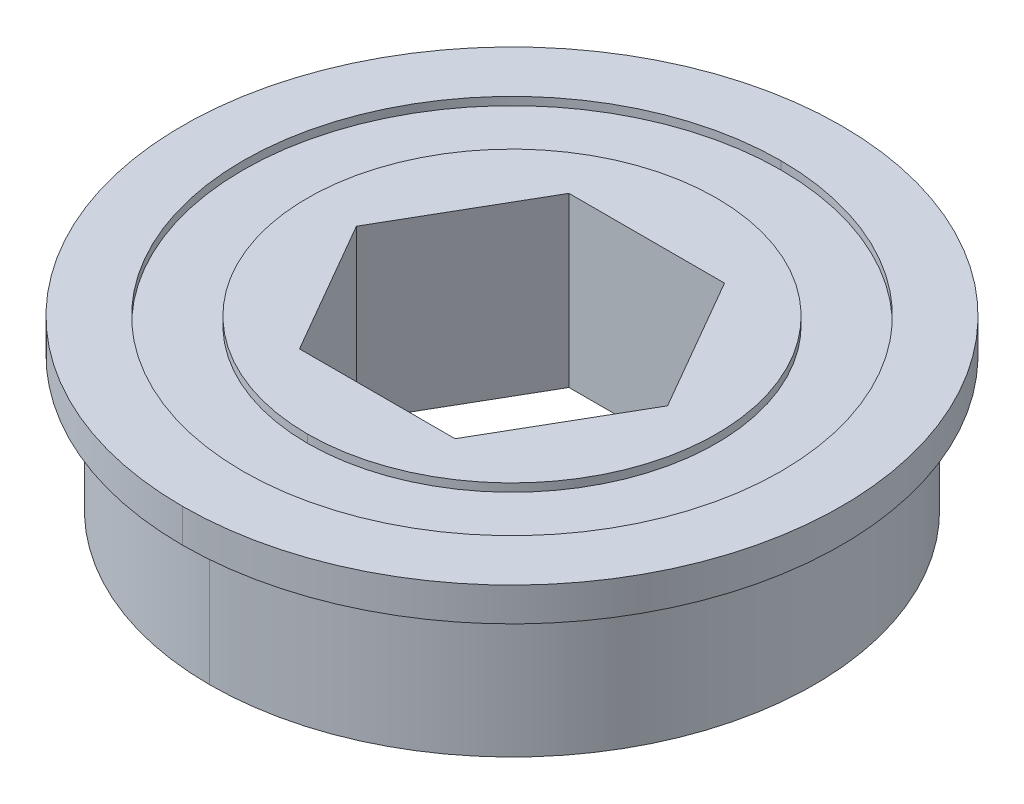
ISO-10303-21;
HEADER;
FILE_DESCRIPTION(('STEP AP214'),'2;1');
FILE_NAME('part.step','',(''),(''),'','','');
FILE_SCHEMA(('AUTOMOTIVE_DESIGN { 1 0 10303 214 1 1 1 1 }'));
ENDSEC;
DATA;
#1=APPLICATION_CONTEXT('core data for automotive mechanical design processes');
#2=APPLICATION_PROTOCOL_DEFINITION('international standard','automotive_design',2000,#1);
#3=PRODUCT_CONTEXT('',#1,'mechanical');
#4=PRODUCT('Part','Part','',(#3));
#5=PRODUCT_RELATED_PRODUCT_CATEGORY('part','',(#4));
#6=PRODUCT_DEFINITION_FORMATION('','',#4);
#7=PRODUCT_DEFINITION_CONTEXT('part definition',#1,'design');
#8=PRODUCT_DEFINITION('design','',#6,#7);
#9=PRODUCT_DEFINITION_SHAPE('','',#8);
#10=(LENGTH_UNIT() NAMED_UNIT(*) SI_UNIT(.MILLI.,.METRE.));
#11=(NAMED_UNIT(*) PLANE_ANGLE_UNIT() SI_UNIT($,.RADIAN.));
#12=(NAMED_UNIT(*) SI_UNIT($,.STERADIAN.) SOLID_ANGLE_UNIT());
#13=UNCERTAINTY_MEASURE_WITH_UNIT(LENGTH_MEASURE(1.E-05),#10,'distance_accuracy_value','');
#14=(GEOMETRIC_REPRESENTATION_CONTEXT(3) GLOBAL_UNCERTAINTY_ASSIGNED_CONTEXT((#13)) GLOBAL_UNIT_ASSIGNED_CONTEXT((#10,
#11,#12)) REPRESENTATION_CONTEXT('',''));
#15=CARTESIAN_POINT('',(0.,0.,0.));
#16=DIRECTION('',(0.,0.,1.));
#17=DIRECTION('',(1.,0.,0.));
#18=AXIS2_PLACEMENT_3D('',#15,#16,#17);
#19=CARTESIAN_POINT('',(3.67194771204602,0.,-6.36));
#20=DIRECTION('',(0.,0.,-1.));
#21=DIRECTION('',(-1.,0.,0.));
#22=AXIS2_PLACEMENT_3D('',#19,#20,#21);
#23=PLANE('',#22);
#24=DIRECTION('',(-1.,0.,0.));
#25=VECTOR('',#24,1.);
#26=CARTESIAN_POINT('',(3.67194771204602,7.9375,-6.36));
#27=LINE('',#26,#25);
#28=CARTESIAN_POINT('',(3.67194771204602,7.9375,-6.36));
#29=VERTEX_POINT('',#28);
#30=CARTESIAN_POINT('',(-3.67194771204602,7.9375,-6.36));
#31=VERTEX_POINT('',#30);
#32=EDGE_CURVE('E241',#29,#31,#27,.T.);
#33=ORIENTED_EDGE('',*,*,#32,.T.);
#34=DIRECTION('',(0.,1.,0.));
#35=VECTOR('',#34,1.);
#36=CARTESIAN_POINT('',(-3.67194771204602,0.,-6.36));
#37=LINE('',#36,#35);
#38=CARTESIAN_POINT('',(-3.67194771204602,0.,-6.36));
#39=VERTEX_POINT('',#38);
#40=EDGE_CURVE('E11',#39,#31,#37,.T.);
#41=ORIENTED_EDGE('',*,*,#40,.F.);
#42=DIRECTION('',(-1.,0.,0.));
#43=VECTOR('',#42,1.);
#44=CARTESIAN_POINT('',(3.67194771204602,0.,-6.36));
#45=LINE('',#44,#43);
#46=CARTESIAN_POINT('',(3.67194771204602,0.,-6.36));
#47=VERTEX_POINT('',#46);
#48=EDGE_CURVE('E330',#47,#39,#45,.T.);
#49=ORIENTED_EDGE('',*,*,#48,.F.);
#50=DIRECTION('',(0.,1.,0.));
#51=VECTOR('',#50,1.);
#52=CARTESIAN_POINT('',(3.67194771204602,0.,-6.36));
#53=LINE('',#52,#51);
#54=EDGE_CURVE('E237',#47,#29,#53,.T.);
#55=ORIENTED_EDGE('',*,*,#54,.T.);
#56=EDGE_LOOP('',(#33,#41,#49,#55));
#57=FACE_BOUND('',#56,.T.);
#58=ADVANCED_FACE('F16',(#57),#23,.F.);
#59=CARTESIAN_POINT('',(-3.67194771204602,0.,-6.36));
#60=DIRECTION('',(-0.866025403784439,0.,-0.5));
#61=DIRECTION('',(-0.5,0.,0.866025403784439));
#62=AXIS2_PLACEMENT_3D('',#59,#60,#61);
#63=PLANE('',#62);
#64=DIRECTION('',(-0.5,0.,0.866025403784439));
#65=VECTOR('',#64,1.);
#66=CARTESIAN_POINT('',(-3.67194771204602,7.9375,-6.36));
#67=LINE('',#66,#65);
#68=CARTESIAN_POINT('',(-7.34389542409204,7.9375,0.));
#69=VERTEX_POINT('',#68);
#70=EDGE_CURVE('E281',#31,#69,#67,.T.);
#71=ORIENTED_EDGE('',*,*,#70,.T.);
#72=DIRECTION('',(0.,1.,0.));
#73=VECTOR('',#72,1.);
#74=CARTESIAN_POINT('',(-7.34389542409204,0.,0.));
#75=LINE('',#74,#73);
#76=CARTESIAN_POINT('',(-7.34389542409204,0.,0.));
#77=VERTEX_POINT('',#76);
#78=EDGE_CURVE('E27',#77,#69,#75,.T.);
#79=ORIENTED_EDGE('',*,*,#78,.F.);
#80=DIRECTION('',(-0.5,0.,0.866025403784439));
#81=VECTOR('',#80,1.);
#82=CARTESIAN_POINT('',(-3.67194771204602,0.,-6.36));
#83=LINE('',#82,#81);
#84=EDGE_CURVE('E205',#39,#77,#83,.T.);
#85=ORIENTED_EDGE('',*,*,#84,.F.);
#86=ORIENTED_EDGE('',*,*,#40,.T.);
#87=EDGE_LOOP('',(#71,#79,#85,#86));
#88=FACE_BOUND('',#87,.T.);
#89=ADVANCED_FACE('F434',(#88),#63,.F.);
#90=CARTESIAN_POINT('',(-7.34389542409204,0.,0.));
#91=DIRECTION('',(-0.866025403784439,0.,0.5));
#92=DIRECTION('',(0.,1.,0.));
#93=AXIS2_PLACEMENT_3D('',#90,#91,#92);
#94=PLANE('',#93);
#95=DIRECTION('',(0.5,0.,0.866025403784439));
#96=VECTOR('',#95,1.);
#97=CARTESIAN_POINT('',(-7.34389542409204,7.9375,0.));
#98=LINE('',#97,#96);
#99=CARTESIAN_POINT('',(-3.67194771204601,7.9375,6.36));
#100=VERTEX_POINT('',#99);
#101=EDGE_CURVE('E261',#69,#100,#98,.T.);
#102=ORIENTED_EDGE('',*,*,#101,.T.);
#103=DIRECTION('',(0.,1.,0.));
#104=VECTOR('',#103,1.);
#105=CARTESIAN_POINT('',(-3.67194771204601,0.,6.36));
#106=LINE('',#105,#104);
#107=CARTESIAN_POINT('',(-3.67194771204601,0.,6.36));
#108=VERTEX_POINT('',#107);
#109=EDGE_CURVE('E272',#108,#100,#106,.T.);
#110=ORIENTED_EDGE('',*,*,#109,.F.);
#111=DIRECTION('',(0.5,0.,0.866025403784439));
#112=VECTOR('',#111,1.);
#113=CARTESIAN_POINT('',(-7.34389542409204,0.,0.));
#114=LINE('',#113,#112);
#115=EDGE_CURVE('E346',#77,#108,#114,.T.);
#116=ORIENTED_EDGE('',*,*,#115,.F.);
#117=ORIENTED_EDGE('',*,*,#78,.T.);
#118=EDGE_LOOP('',(#102,#110,#116,#117));
#119=FACE_BOUND('',#118,.T.);
#120=ADVANCED_FACE('F565',(#119),#94,.F.);
#121=CARTESIAN_POINT('',(-3.67194771204601,0.,6.36));
#122=DIRECTION('',(0.,0.,1.));
#123=DIRECTION('',(1.,0.,0.));
#124=AXIS2_PLACEMENT_3D('',#121,#122,#123);
#125=PLANE('',#124);
#126=DIRECTION('',(1.,0.,0.));
#127=VECTOR('',#126,1.);
#128=CARTESIAN_POINT('',(-3.67194771204601,7.9375,6.36));
#129=LINE('',#128,#127);
#130=CARTESIAN_POINT('',(3.67194771204602,7.9375,6.36));
#131=VERTEX_POINT('',#130);
#132=EDGE_CURVE('E257',#100,#131,#129,.T.);
#133=ORIENTED_EDGE('',*,*,#132,.T.);
#134=DIRECTION('',(0.,1.,0.));
#135=VECTOR('',#134,1.);
#136=CARTESIAN_POINT('',(3.67194771204602,0.,6.36));
#137=LINE('',#136,#135);
#138=CARTESIAN_POINT('',(3.67194771204602,0.,6.36));
#139=VERTEX_POINT('',#138);
#140=EDGE_CURVE('E296',#139,#131,#137,.T.);
#141=ORIENTED_EDGE('',*,*,#140,.F.);
#142=DIRECTION('',(1.,0.,0.));
#143=VECTOR('',#142,1.);
#144=CARTESIAN_POINT('',(-3.67194771204601,0.,6.36));
#145=LINE('',#144,#143);
#146=EDGE_CURVE('E350',#108,#139,#145,.T.);
#147=ORIENTED_EDGE('',*,*,#146,.F.);
#148=ORIENTED_EDGE('',*,*,#109,.T.);
#149=EDGE_LOOP('',(#133,#141,#147,#148));
#150=FACE_BOUND('',#149,.T.);
#151=ADVANCED_FACE('F559',(#150),#125,.F.);
#152=CARTESIAN_POINT('',(3.67194771204602,0.,6.36));
#153=DIRECTION('',(0.866025403784439,0.,0.5));
#154=DIRECTION('',(0.,-1.,0.));
#155=AXIS2_PLACEMENT_3D('',#152,#153,#154);
#156=PLANE('',#155);
#157=DIRECTION('',(0.5,0.,-0.866025403784439));
#158=VECTOR('',#157,1.);
#159=CARTESIAN_POINT('',(3.67194771204602,7.9375,6.36));
#160=LINE('',#159,#158);
#161=CARTESIAN_POINT('',(7.34389542409204,7.9375,0.));
#162=VERTEX_POINT('',#161);
#163=EDGE_CURVE('E262',#131,#162,#160,.T.);
#164=ORIENTED_EDGE('',*,*,#163,.T.);
#165=DIRECTION('',(0.,1.,0.));
#166=VECTOR('',#165,1.);
#167=CARTESIAN_POINT('',(7.34389542409204,0.,0.));
#168=LINE('',#167,#166);
#169=CARTESIAN_POINT('',(7.34389542409204,0.,0.));
#170=VERTEX_POINT('',#169);
#171=EDGE_CURVE('E240',#170,#162,#168,.T.);
#172=ORIENTED_EDGE('',*,*,#171,.F.);
#173=DIRECTION('',(0.5,0.,-0.866025403784439));
#174=VECTOR('',#173,1.);
#175=CARTESIAN_POINT('',(3.67194771204602,0.,6.36));
#176=LINE('',#175,#174);
#177=EDGE_CURVE('E302',#139,#170,#176,.T.);
#178=ORIENTED_EDGE('',*,*,#177,.F.);
#179=ORIENTED_EDGE('',*,*,#140,.T.);
#180=EDGE_LOOP('',(#164,#172,#178,#179));
#181=FACE_BOUND('',#180,.T.);
#182=ADVANCED_FACE('F564',(#181),#156,.F.);
#183=CARTESIAN_POINT('',(7.34389542409204,0.,0.));
#184=DIRECTION('',(0.866025403784439,0.,-0.5));
#185=DIRECTION('',(0.,-1.,0.));
#186=AXIS2_PLACEMENT_3D('',#183,#184,#185);
#187=PLANE('',#186);
#188=DIRECTION('',(-0.5,0.,-0.866025403784439));
#189=VECTOR('',#188,1.);
#190=CARTESIAN_POINT('',(7.34389542409204,7.9375,0.));
#191=LINE('',#190,#189);
#192=EDGE_CURVE('E298',#162,#29,#191,.T.);
#193=ORIENTED_EDGE('',*,*,#192,.T.);
#194=ORIENTED_EDGE('',*,*,#54,.F.);
#195=DIRECTION('',(-0.5,0.,-0.866025403784439));
#196=VECTOR('',#195,1.);
#197=CARTESIAN_POINT('',(7.34389542409204,0.,0.));
#198=LINE('',#197,#196);
#199=EDGE_CURVE('E265',#170,#47,#198,.T.);
#200=ORIENTED_EDGE('',*,*,#199,.F.);
#201=ORIENTED_EDGE('',*,*,#171,.T.);
#202=EDGE_LOOP('',(#193,#194,#200,#201));
#203=FACE_BOUND('',#202,.T.);
#204=ADVANCED_FACE('F429',(#203),#187,.F.);
#205=CARTESIAN_POINT('',(6.35,7.9375,0.));
#206=DIRECTION('',(0.,1.,0.));
#207=DIRECTION('',(1.,0.,0.));
#208=AXIS2_PLACEMENT_3D('',#205,#206,#207);
#209=PLANE('',#208);
#210=ORIENTED_EDGE('',*,*,#192,.F.);
#211=ORIENTED_EDGE('',*,*,#163,.F.);
#212=ORIENTED_EDGE('',*,*,#132,.F.);
#213=ORIENTED_EDGE('',*,*,#101,.F.);
#214=ORIENTED_EDGE('',*,*,#70,.F.);
#215=ORIENTED_EDGE('',*,*,#32,.F.);
#216=EDGE_LOOP('',(#210,#211,#212,#213,#214,#215));
#217=FACE_BOUND('',#216,.T.);
#218=CARTESIAN_POINT('',(0.,7.9375,0.));
#219=DIRECTION('',(0.,1.,0.));
#220=DIRECTION('',(0.,0.,1.));
#221=AXIS2_PLACEMENT_3D('',#218,#219,#220);
#222=CIRCLE('',#221,9.652);
#223=CARTESIAN_POINT('',(0.,7.9375,9.652));
#224=VERTEX_POINT('',#223);
#225=CARTESIAN_POINT('',(0.,7.9375,-9.652));
#226=VERTEX_POINT('',#225);
#227=EDGE_CURVE('E211',#224,#226,#222,.T.);
#228=ORIENTED_EDGE('',*,*,#227,.T.);
#229=CARTESIAN_POINT('',(0.,7.9375,0.));
#230=DIRECTION('',(0.,1.,0.));
#231=DIRECTION('',(0.,0.,1.));
#232=AXIS2_PLACEMENT_3D('',#229,#230,#231);
#233=CIRCLE('',#232,9.652);
#234=EDGE_CURVE('E266',#226,#224,#233,.T.);
#235=ORIENTED_EDGE('',*,*,#234,.T.);
#236=EDGE_LOOP('',(#228,#235));
#237=FACE_BOUND('',#236,.T.);
#238=ADVANCED_FACE('F18',(#217,#237),#209,.T.);
#239=CARTESIAN_POINT('',(9.652,0.,0.));
#240=DIRECTION('',(0.,-1.,0.));
#241=DIRECTION('',(0.,0.,-1.));
#242=AXIS2_PLACEMENT_3D('',#239,#240,#241);
#243=PLANE('',#242);
#244=ORIENTED_EDGE('',*,*,#199,.T.);
#245=ORIENTED_EDGE('',*,*,#48,.T.);
#246=ORIENTED_EDGE('',*,*,#84,.T.);
#247=ORIENTED_EDGE('',*,*,#115,.T.);
#248=ORIENTED_EDGE('',*,*,#146,.T.);
#249=ORIENTED_EDGE('',*,*,#177,.T.);
#250=EDGE_LOOP('',(#244,#245,#246,#247,#248,#249));
#251=FACE_BOUND('',#250,.T.);
#252=CARTESIAN_POINT('',(0.,0.,0.));
#253=DIRECTION('',(0.,1.,0.));
#254=DIRECTION('',(0.,0.,1.));
#255=AXIS2_PLACEMENT_3D('',#252,#253,#254);
#256=CIRCLE('',#255,9.652);
#257=CARTESIAN_POINT('',(0.,0.,9.652));
#258=VERTEX_POINT('',#257);
#259=CARTESIAN_POINT('',(0.,0.,-9.652));
#260=VERTEX_POINT('',#259);
#261=EDGE_CURVE('E365',#258,#260,#256,.T.);
#262=ORIENTED_EDGE('',*,*,#261,.F.);
#263=CARTESIAN_POINT('',(0.,0.,0.));
#264=DIRECTION('',(0.,1.,0.));
#265=DIRECTION('',(0.,0.,1.));
#266=AXIS2_PLACEMENT_3D('',#263,#264,#265);
#267=CIRCLE('',#266,9.652);
#268=EDGE_CURVE('E256',#260,#258,#267,.T.);
#269=ORIENTED_EDGE('',*,*,#268,.F.);
#270=EDGE_LOOP('',(#262,#269));
#271=FACE_BOUND('',#270,.T.);
#272=ADVANCED_FACE('F425',(#251,#271),#243,.T.);
#273=CARTESIAN_POINT('',(0.,0.,0.));
#274=DIRECTION('',(0.,1.,0.));
#275=DIRECTION('',(0.,0.,1.));
#276=AXIS2_PLACEMENT_3D('',#273,#274,#275);
#277=CYLINDRICAL_SURFACE('',#276,9.652);
#278=DIRECTION('',(0.,1.,0.));
#279=VECTOR('',#278,1.);
#280=CARTESIAN_POINT('',(0.,0.,-9.652));
#281=LINE('',#280,#279);
#282=CARTESIAN_POINT('',(0.,0.381,-9.652));
#283=VERTEX_POINT('',#282);
#284=EDGE_CURVE('E290',#260,#283,#281,.T.);
#285=ORIENTED_EDGE('',*,*,#284,.F.);
#286=ORIENTED_EDGE('',*,*,#268,.T.);
#287=DIRECTION('',(0.,1.,0.));
#288=VECTOR('',#287,1.);
#289=CARTESIAN_POINT('',(0.,0.,9.652));
#290=LINE('',#289,#288);
#291=CARTESIAN_POINT('',(0.,0.381,9.652));
#292=VERTEX_POINT('',#291);
#293=EDGE_CURVE('E192',#258,#292,#290,.T.);
#294=ORIENTED_EDGE('',*,*,#293,.T.);
#295=CARTESIAN_POINT('',(0.,0.381,0.));
#296=DIRECTION('',(0.,1.,0.));
#297=DIRECTION('',(0.,0.,1.));
#298=AXIS2_PLACEMENT_3D('',#295,#296,#297);
#299=CIRCLE('',#298,9.652);
#300=EDGE_CURVE('E236',#283,#292,#299,.T.);
#301=ORIENTED_EDGE('',*,*,#300,.F.);
#302=EDGE_LOOP('',(#285,#286,#294,#301));
#303=FACE_BOUND('',#302,.T.);
#304=ADVANCED_FACE('F627',(#303),#277,.T.);
#305=CARTESIAN_POINT('',(9.652,0.381,0.));
#306=DIRECTION('',(0.,-1.,0.));
#307=DIRECTION('',(0.,0.,-1.));
#308=AXIS2_PLACEMENT_3D('',#305,#306,#307);
#309=PLANE('',#308);
#310=CARTESIAN_POINT('',(0.,0.381,0.));
#311=DIRECTION('',(0.,1.,0.));
#312=DIRECTION('',(0.,0.,1.));
#313=AXIS2_PLACEMENT_3D('',#310,#311,#312);
#314=CIRCLE('',#313,9.652);
#315=EDGE_CURVE('E201',#292,#283,#314,.T.);
#316=ORIENTED_EDGE('',*,*,#315,.T.);
#317=ORIENTED_EDGE('',*,*,#300,.T.);
#318=EDGE_LOOP('',(#316,#317));
#319=FACE_BOUND('',#318,.T.);
#320=CARTESIAN_POINT('',(0.,0.381,0.));
#321=DIRECTION('',(0.,1.,0.));
#322=DIRECTION('',(0.,0.,1.));
#323=AXIS2_PLACEMENT_3D('',#320,#321,#322);
#324=CIRCLE('',#323,12.7);
#325=CARTESIAN_POINT('',(0.,0.381,12.7));
#326=VERTEX_POINT('',#325);
#327=CARTESIAN_POINT('',(0.,0.381,-12.7));
#328=VERTEX_POINT('',#327);
#329=EDGE_CURVE('E178',#326,#328,#324,.T.);
#330=ORIENTED_EDGE('',*,*,#329,.F.);
#331=CARTESIAN_POINT('',(0.,0.381,0.));
#332=DIRECTION('',(0.,1.,0.));
#333=DIRECTION('',(0.,0.,1.));
#334=AXIS2_PLACEMENT_3D('',#331,#332,#333);
#335=CIRCLE('',#334,12.7);
#336=EDGE_CURVE('E185',#328,#326,#335,.T.);
#337=ORIENTED_EDGE('',*,*,#336,.F.);
#338=EDGE_LOOP('',(#330,#337));
#339=FACE_BOUND('',#338,.T.);
#340=ADVANCED_FACE('F614',(#319,#339),#309,.T.);
#341=CARTESIAN_POINT('',(0.,0.,0.));
#342=DIRECTION('',(0.,1.,0.));
#343=DIRECTION('',(0.,0.,1.));
#344=AXIS2_PLACEMENT_3D('',#341,#342,#343);
#345=CYLINDRICAL_SURFACE('',#344,12.7);
#346=DIRECTION('',(0.,1.,0.));
#347=VECTOR('',#346,1.);
#348=CARTESIAN_POINT('',(0.,0.,-12.7));
#349=LINE('',#348,#347);
#350=CARTESIAN_POINT('',(0.,0.,-12.7));
#351=VERTEX_POINT('',#350);
#352=EDGE_CURVE('E173',#351,#328,#349,.T.);
#353=ORIENTED_EDGE('',*,*,#352,.F.);
#354=CARTESIAN_POINT('',(0.,0.,0.));
#355=DIRECTION('',(0.,1.,0.));
#356=DIRECTION('',(0.,0.,1.));
#357=AXIS2_PLACEMENT_3D('',#354,#355,#356);
#358=CIRCLE('',#357,12.7);
#359=CARTESIAN_POINT('',(0.,0.,12.7));
#360=VERTEX_POINT('',#359);
#361=EDGE_CURVE('E167',#360,#351,#358,.T.);
#362=ORIENTED_EDGE('',*,*,#361,.F.);
#363=DIRECTION('',(0.,1.,0.));
#364=VECTOR('',#363,1.);
#365=CARTESIAN_POINT('',(0.,0.,12.7));
#366=LINE('',#365,#364);
#367=EDGE_CURVE('E170',#360,#326,#366,.T.);
#368=ORIENTED_EDGE('',*,*,#367,.T.);
#369=ORIENTED_EDGE('',*,*,#329,.T.);
#370=EDGE_LOOP('',(#353,#362,#368,#369));
#371=FACE_BOUND('',#370,.T.);
#372=ADVANCED_FACE('F169',(#371),#345,.F.);
#373=CARTESIAN_POINT('',(14.2748,0.,0.));
#374=DIRECTION('',(0.,-1.,0.));
#375=DIRECTION('',(0.,0.,-1.));
#376=AXIS2_PLACEMENT_3D('',#373,#374,#375);
#377=PLANE('',#376);
#378=ORIENTED_EDGE('',*,*,#361,.T.);
#379=CARTESIAN_POINT('',(0.,0.,0.));
#380=DIRECTION('',(0.,1.,0.));
#381=DIRECTION('',(0.,0.,1.));
#382=AXIS2_PLACEMENT_3D('',#379,#380,#381);
#383=CIRCLE('',#382,12.7);
#384=EDGE_CURVE('E183',#351,#360,#383,.T.);
#385=ORIENTED_EDGE('',*,*,#384,.T.);
#386=EDGE_LOOP('',(#378,#385));
#387=FACE_BOUND('',#386,.T.);
#388=CARTESIAN_POINT('',(0.,0.,0.));
#389=DIRECTION('',(0.,1.,0.));
#390=DIRECTION('',(0.,0.,1.));
#391=AXIS2_PLACEMENT_3D('',#388,#389,#390);
#392=CIRCLE('',#391,14.2748);
#393=CARTESIAN_POINT('',(0.,0.,14.2748));
#394=VERTEX_POINT('',#393);
#395=CARTESIAN_POINT('',(0.,0.,-14.2748));
#396=VERTEX_POINT('',#395);
#397=EDGE_CURVE('E187',#394,#396,#392,.T.);
#398=ORIENTED_EDGE('',*,*,#397,.F.);
#399=CARTESIAN_POINT('',(0.,0.,0.));
#400=DIRECTION('',(0.,1.,0.));
#401=DIRECTION('',(0.,0.,1.));
#402=AXIS2_PLACEMENT_3D('',#399,#400,#401);
#403=CIRCLE('',#402,14.2748);
#404=EDGE_CURVE('E179',#396,#394,#403,.T.);
#405=ORIENTED_EDGE('',*,*,#404,.F.);
#406=EDGE_LOOP('',(#398,#405));
#407=FACE_BOUND('',#406,.T.);
#408=ADVANCED_FACE('F189',(#387,#407),#377,.T.);
#409=CARTESIAN_POINT('',(0.,0.,0.));
#410=DIRECTION('',(0.,1.,0.));
#411=DIRECTION('',(0.,0.,1.));
#412=AXIS2_PLACEMENT_3D('',#409,#410,#411);
#413=CYLINDRICAL_SURFACE('',#412,14.2748);
#414=DIRECTION('',(0.,1.,0.));
#415=VECTOR('',#414,1.);
#416=CARTESIAN_POINT('',(0.,0.,-14.2748));
#417=LINE('',#416,#415);
#418=CARTESIAN_POINT('',(0.,5.6,-14.2748));
#419=VERTEX_POINT('',#418);
#420=EDGE_CURVE('E213',#396,#419,#417,.T.);
#421=ORIENTED_EDGE('',*,*,#420,.F.);
#422=ORIENTED_EDGE('',*,*,#404,.T.);
#423=DIRECTION('',(0.,1.,0.));
#424=VECTOR('',#423,1.);
#425=CARTESIAN_POINT('',(0.,0.,14.2748));
#426=LINE('',#425,#424);
#427=CARTESIAN_POINT('',(0.,5.6,14.2748));
#428=VERTEX_POINT('',#427);
#429=EDGE_CURVE('E306',#394,#428,#426,.T.);
#430=ORIENTED_EDGE('',*,*,#429,.T.);
#431=CARTESIAN_POINT('',(0.,5.6,0.));
#432=DIRECTION('',(0.,1.,0.));
#433=DIRECTION('',(0.,0.,1.));
#434=AXIS2_PLACEMENT_3D('',#431,#432,#433);
#435=CIRCLE('',#434,14.2748);
#436=EDGE_CURVE('E286',#419,#428,#435,.T.);
#437=ORIENTED_EDGE('',*,*,#436,.F.);
#438=EDGE_LOOP('',(#421,#422,#430,#437));
#439=FACE_BOUND('',#438,.T.);
#440=ADVANCED_FACE('F639',(#439),#413,.T.);
#441=CARTESIAN_POINT('',(0.,5.975,0.));
#442=DIRECTION('',(0.,-1.,0.));
#443=DIRECTION('',(0.,0.,-1.));
#444=AXIS2_PLACEMENT_3D('',#441,#442,#443);
#445=CONICAL_SURFACE('',#444,14.0582936490539,0.523598775598298);
#446=DIRECTION('',(0.,-0.86602540378444,0.5));
#447=VECTOR('',#446,1.);
#448=CARTESIAN_POINT('',(0.,5.975,14.0582936490539));
#449=LINE('',#448,#447);
#450=CARTESIAN_POINT('',(0.,5.975,14.0582936490539));
#451=VERTEX_POINT('',#450);
#452=EDGE_CURVE('E345',#451,#428,#449,.T.);
#453=ORIENTED_EDGE('',*,*,#452,.F.);
#454=CARTESIAN_POINT('',(0.,5.975,0.));
#455=DIRECTION('',(0.,1.,0.));
#456=DIRECTION('',(0.,0.,1.));
#457=AXIS2_PLACEMENT_3D('',#454,#455,#456);
#458=CIRCLE('',#457,14.0582936490539);
#459=CARTESIAN_POINT('',(0.,5.975,-14.0582936490539));
#460=VERTEX_POINT('',#459);
#461=EDGE_CURVE('E222',#460,#451,#458,.T.);
#462=ORIENTED_EDGE('',*,*,#461,.F.);
#463=DIRECTION('',(0.,-0.86602540378444,-0.5));
#464=VECTOR('',#463,1.);
#465=CARTESIAN_POINT('',(0.,5.975,-14.0582936490539));
#466=LINE('',#465,#464);
#467=EDGE_CURVE('E223',#460,#419,#466,.T.);
#468=ORIENTED_EDGE('',*,*,#467,.T.);
#469=ORIENTED_EDGE('',*,*,#436,.T.);
#470=EDGE_LOOP('',(#453,#462,#468,#469));
#471=FACE_BOUND('',#470,.T.);
#472=ADVANCED_FACE('F677',(#471),#445,.T.);
#473=CARTESIAN_POINT('',(0.,6.1,0.));
#474=DIRECTION('',(0.,1.,0.));
#475=DIRECTION('',(0.,0.,1.));
#476=AXIS2_PLACEMENT_3D('',#473,#474,#475);
#477=TOROIDAL_SURFACE('',#476,14.2748,0.25);
#478=CARTESIAN_POINT('',(0.,6.1,0.));
#479=DIRECTION('',(0.,1.,0.));
#480=DIRECTION('',(0.,0.,1.));
#481=AXIS2_PLACEMENT_3D('',#478,#479,#480);
#482=CIRCLE('',#481,14.0248);
#483=CARTESIAN_POINT('',(0.,6.1,14.0248));
#484=VERTEX_POINT('',#483);
#485=CARTESIAN_POINT('',(0.,6.1,-14.0248));
#486=VERTEX_POINT('',#485);
#487=EDGE_CURVE('E320',#484,#486,#482,.T.);
#488=ORIENTED_EDGE('',*,*,#487,.F.);
#489=CARTESIAN_POINT('',(0.,6.1,14.2748));
#490=DIRECTION('',(-1.,0.,0.));
#491=DIRECTION('',(0.,0.,1.));
#492=AXIS2_PLACEMENT_3D('',#489,#490,#491);
#493=CIRCLE('',#492,0.25);
#494=EDGE_CURVE('E224',#484,#451,#493,.T.);
#495=ORIENTED_EDGE('',*,*,#494,.T.);
#496=CARTESIAN_POINT('',(0.,5.975,0.));
#497=DIRECTION('',(0.,1.,0.));
#498=DIRECTION('',(0.,0.,1.));
#499=AXIS2_PLACEMENT_3D('',#496,#497,#498);
#500=CIRCLE('',#499,14.0582936490539);
#501=EDGE_CURVE('E371',#451,#460,#500,.T.);
#502=ORIENTED_EDGE('',*,*,#501,.T.);
#503=CARTESIAN_POINT('',(0.,6.1,-14.2748));
#504=DIRECTION('',(1.,0.,0.));
#505=DIRECTION('',(0.,0.,-1.));
#506=AXIS2_PLACEMENT_3D('',#503,#504,#505);
#507=CIRCLE('',#506,0.25);
#508=EDGE_CURVE('E218',#486,#460,#507,.T.);
#509=ORIENTED_EDGE('',*,*,#508,.F.);
#510=EDGE_LOOP('',(#488,#495,#502,#509));
#511=FACE_BOUND('',#510,.T.);
#512=ADVANCED_FACE('F671',(#511),#477,.F.);
#513=CARTESIAN_POINT('',(15.5575,6.35,0.));
#514=DIRECTION('',(0.,-1.,0.));
#515=DIRECTION('',(0.,0.,-1.));
#516=AXIS2_PLACEMENT_3D('',#513,#514,#515);
#517=PLANE('',#516);
#518=CARTESIAN_POINT('',(0.,6.35,0.));
#519=DIRECTION('',(0.,1.,0.));
#520=DIRECTION('',(0.,0.,1.));
#521=AXIS2_PLACEMENT_3D('',#518,#519,#520);
#522=CIRCLE('',#521,14.2748);
#523=CARTESIAN_POINT('',(0.,6.35,14.2748));
#524=VERTEX_POINT('',#523);
#525=CARTESIAN_POINT('',(0.,6.35,-14.2748));
#526=VERTEX_POINT('',#525);
#527=EDGE_CURVE('E316',#524,#526,#522,.T.);
#528=ORIENTED_EDGE('',*,*,#527,.T.);
#529=CARTESIAN_POINT('',(0.,6.35,0.));
#530=DIRECTION('',(0.,1.,0.));
#531=DIRECTION('',(0.,0.,1.));
#532=AXIS2_PLACEMENT_3D('',#529,#530,#531);
#533=CIRCLE('',#532,14.2748);
#534=EDGE_CURVE('E315',#526,#524,#533,.T.);
#535=ORIENTED_EDGE('',*,*,#534,.T.);
#536=EDGE_LOOP('',(#528,#535));
#537=FACE_BOUND('',#536,.T.);
#538=CARTESIAN_POINT('',(0.,6.35,0.));
#539=DIRECTION('',(0.,1.,0.));
#540=DIRECTION('',(0.,0.,1.));
#541=AXIS2_PLACEMENT_3D('',#538,#539,#540);
#542=CIRCLE('',#541,15.5575);
#543=CARTESIAN_POINT('',(0.,6.35,15.5575));
#544=VERTEX_POINT('',#543);
#545=CARTESIAN_POINT('',(0.,6.35,-15.5575));
#546=VERTEX_POINT('',#545);
#547=EDGE_CURVE('E227',#544,#546,#542,.T.);
#548=ORIENTED_EDGE('',*,*,#547,.F.);
#549=CARTESIAN_POINT('',(0.,6.35,0.));
#550=DIRECTION('',(0.,1.,0.));
#551=DIRECTION('',(0.,0.,1.));
#552=AXIS2_PLACEMENT_3D('',#549,#550,#551);
#553=CIRCLE('',#552,15.5575);
#554=EDGE_CURVE('E232',#546,#544,#553,.T.);
#555=ORIENTED_EDGE('',*,*,#554,.F.);
#556=EDGE_LOOP('',(#548,#555));
#557=FACE_BOUND('',#556,.T.);
#558=ADVANCED_FACE('F676',(#537,#557),#517,.T.);
#559=CARTESIAN_POINT('',(0.,0.,0.));
#560=DIRECTION('',(0.,1.,0.));
#561=DIRECTION('',(0.,0.,1.));
#562=AXIS2_PLACEMENT_3D('',#559,#560,#561);
#563=CYLINDRICAL_SURFACE('',#562,15.5575);
#564=DIRECTION('',(0.,1.,0.));
#565=VECTOR('',#564,1.);
#566=CARTESIAN_POINT('',(0.,0.,-15.5575));
#567=LINE('',#566,#565);
#568=CARTESIAN_POINT('',(0.,7.9375,-15.5575));
#569=VERTEX_POINT('',#568);
#570=EDGE_CURVE('E248',#546,#569,#567,.T.);
#571=ORIENTED_EDGE('',*,*,#570,.F.);
#572=ORIENTED_EDGE('',*,*,#554,.T.);
#573=DIRECTION('',(0.,1.,0.));
#574=VECTOR('',#573,1.);
#575=CARTESIAN_POINT('',(0.,0.,15.5575));
#576=LINE('',#575,#574);
#577=CARTESIAN_POINT('',(0.,7.9375,15.5575));
#578=VERTEX_POINT('',#577);
#579=EDGE_CURVE('E326',#544,#578,#576,.T.);
#580=ORIENTED_EDGE('',*,*,#579,.T.);
#581=CARTESIAN_POINT('',(0.,7.9375,0.));
#582=DIRECTION('',(0.,1.,0.));
#583=DIRECTION('',(0.,0.,1.));
#584=AXIS2_PLACEMENT_3D('',#581,#582,#583);
#585=CIRCLE('',#584,15.5575);
#586=EDGE_CURVE('E228',#569,#578,#585,.T.);
#587=ORIENTED_EDGE('',*,*,#586,.F.);
#588=EDGE_LOOP('',(#571,#572,#580,#587));
#589=FACE_BOUND('',#588,.T.);
#590=ADVANCED_FACE('F550',(#589),#563,.T.);
#591=CARTESIAN_POINT('',(12.7,7.9375,0.));
#592=DIRECTION('',(0.,1.,0.));
#593=DIRECTION('',(1.,0.,0.));
#594=AXIS2_PLACEMENT_3D('',#591,#592,#593);
#595=PLANE('',#594);
#596=CARTESIAN_POINT('',(0.,7.9375,0.));
#597=DIRECTION('',(0.,1.,0.));
#598=DIRECTION('',(0.,0.,1.));
#599=AXIS2_PLACEMENT_3D('',#596,#597,#598);
#600=CIRCLE('',#599,12.7);
#601=CARTESIAN_POINT('',(0.,7.9375,12.7));
#602=VERTEX_POINT('',#601);
#603=CARTESIAN_POINT('',(0.,7.9375,-12.7));
#604=VERTEX_POINT('',#603);
#605=EDGE_CURVE('E233',#602,#604,#600,.T.);
#606=ORIENTED_EDGE('',*,*,#605,.F.);
#607=CARTESIAN_POINT('',(0.,7.9375,0.));
#608=DIRECTION('',(0.,1.,0.));
#609=DIRECTION('',(0.,0.,1.));
#610=AXIS2_PLACEMENT_3D('',#607,#608,#609);
#611=CIRCLE('',#610,12.7);
#612=EDGE_CURVE('E334',#604,#602,#611,.T.);
#613=ORIENTED_EDGE('',*,*,#612,.F.);
#614=EDGE_LOOP('',(#606,#613));
#615=FACE_BOUND('',#614,.T.);
#616=CARTESIAN_POINT('',(0.,7.9375,0.));
#617=DIRECTION('',(0.,1.,0.));
#618=DIRECTION('',(0.,0.,1.));
#619=AXIS2_PLACEMENT_3D('',#616,#617,#618);
#620=CIRCLE('',#619,15.5575);
#621=EDGE_CURVE('E252',#578,#569,#620,.T.);
#622=ORIENTED_EDGE('',*,*,#621,.T.);
#623=ORIENTED_EDGE('',*,*,#586,.T.);
#624=EDGE_LOOP('',(#622,#623));
#625=FACE_BOUND('',#624,.T.);
#626=ADVANCED_FACE('F545',(#615,#625),#595,.T.);
#627=CARTESIAN_POINT('',(0.,0.,0.));
#628=DIRECTION('',(0.,1.,0.));
#629=DIRECTION('',(0.,0.,1.));
#630=AXIS2_PLACEMENT_3D('',#627,#628,#629);
#631=CYLINDRICAL_SURFACE('',#630,12.7);
#632=DIRECTION('',(0.,1.,0.));
#633=VECTOR('',#632,1.);
#634=CARTESIAN_POINT('',(0.,0.,-12.7));
#635=LINE('',#634,#633);
#636=CARTESIAN_POINT('',(0.,7.5565,-12.7));
#637=VERTEX_POINT('',#636);
#638=EDGE_CURVE('E338',#637,#604,#635,.T.);
#639=ORIENTED_EDGE('',*,*,#638,.F.);
#640=CARTESIAN_POINT('',(0.,7.5565,0.));
#641=DIRECTION('',(0.,1.,0.));
#642=DIRECTION('',(0.,0.,1.));
#643=AXIS2_PLACEMENT_3D('',#640,#641,#642);
#644=CIRCLE('',#643,12.7);
#645=CARTESIAN_POINT('',(0.,7.5565,12.7));
#646=VERTEX_POINT('',#645);
#647=EDGE_CURVE('E269',#646,#637,#644,.T.);
#648=ORIENTED_EDGE('',*,*,#647,.F.);
#649=DIRECTION('',(0.,1.,0.));
#650=VECTOR('',#649,1.);
#651=CARTESIAN_POINT('',(0.,0.,12.7));
#652=LINE('',#651,#650);
#653=EDGE_CURVE('E247',#646,#602,#652,.T.);
#654=ORIENTED_EDGE('',*,*,#653,.T.);
#655=ORIENTED_EDGE('',*,*,#605,.T.);
#656=EDGE_LOOP('',(#639,#648,#654,#655));
#657=FACE_BOUND('',#656,.T.);
#658=ADVANCED_FACE('F533',(#657),#631,.F.);
#659=CARTESIAN_POINT('',(9.652,7.5565,0.));
#660=DIRECTION('',(0.,1.,0.));
#661=DIRECTION('',(1.,0.,0.));
#662=AXIS2_PLACEMENT_3D('',#659,#660,#661);
#663=PLANE('',#662);
#664=CARTESIAN_POINT('',(0.,7.5565,0.));
#665=DIRECTION('',(0.,1.,0.));
#666=DIRECTION('',(0.,0.,1.));
#667=AXIS2_PLACEMENT_3D('',#664,#665,#666);
#668=CIRCLE('',#667,9.652);
#669=CARTESIAN_POINT('',(0.,7.5565,9.652));
#670=VERTEX_POINT('',#669);
#671=CARTESIAN_POINT('',(0.,7.5565,-9.652));
#672=VERTEX_POINT('',#671);
#673=EDGE_CURVE('E242',#670,#672,#668,.T.);
#674=ORIENTED_EDGE('',*,*,#673,.F.);
#675=CARTESIAN_POINT('',(0.,7.5565,0.));
#676=DIRECTION('',(0.,1.,0.));
#677=DIRECTION('',(0.,0.,1.));
#678=AXIS2_PLACEMENT_3D('',#675,#676,#677);
#679=CIRCLE('',#678,9.652);
#680=EDGE_CURVE('E210',#672,#670,#679,.T.);
#681=ORIENTED_EDGE('',*,*,#680,.F.);
#682=EDGE_LOOP('',(#674,#681));
#683=FACE_BOUND('',#682,.T.);
#684=ORIENTED_EDGE('',*,*,#647,.T.);
#685=CARTESIAN_POINT('',(0.,7.5565,0.));
#686=DIRECTION('',(0.,1.,0.));
#687=DIRECTION('',(0.,0.,1.));
#688=AXIS2_PLACEMENT_3D('',#685,#686,#687);
#689=CIRCLE('',#688,12.7);
#690=EDGE_CURVE('E20',#637,#646,#689,.T.);
#691=ORIENTED_EDGE('',*,*,#690,.T.);
#692=EDGE_LOOP('',(#684,#691));
#693=FACE_BOUND('',#692,.T.);
#694=ADVANCED_FACE('F527',(#683,#693),#663,.T.);
#695=CARTESIAN_POINT('',(0.,0.,0.));
#696=DIRECTION('',(0.,1.,0.));
#697=DIRECTION('',(0.,0.,1.));
#698=AXIS2_PLACEMENT_3D('',#695,#696,#697);
#699=CYLINDRICAL_SURFACE('',#698,9.652);
#700=DIRECTION('',(0.,1.,0.));
#701=VECTOR('',#700,1.);
#702=CARTESIAN_POINT('',(0.,0.,-9.652));
#703=LINE('',#702,#701);
#704=EDGE_CURVE('E246',#672,#226,#703,.T.);
#705=ORIENTED_EDGE('',*,*,#704,.F.);
#706=ORIENTED_EDGE('',*,*,#680,.T.);
#707=DIRECTION('',(0.,1.,0.));
#708=VECTOR('',#707,1.);
#709=CARTESIAN_POINT('',(0.,0.,9.652));
#710=LINE('',#709,#708);
#711=EDGE_CURVE('E207',#670,#224,#710,.T.);
#712=ORIENTED_EDGE('',*,*,#711,.T.);
#713=ORIENTED_EDGE('',*,*,#234,.F.);
#714=EDGE_LOOP('',(#705,#706,#712,#713));
#715=FACE_BOUND('',#714,.T.);
#716=ADVANCED_FACE('F532',(#715),#699,.T.);
#717=CARTESIAN_POINT('',(0.,0.,0.));
#718=DIRECTION('',(0.,1.,0.));
#719=DIRECTION('',(0.,0.,1.));
#720=AXIS2_PLACEMENT_3D('',#717,#718,#719);
#721=CYLINDRICAL_SURFACE('',#720,9.652);
#722=ORIENTED_EDGE('',*,*,#673,.T.);
#723=ORIENTED_EDGE('',*,*,#704,.T.);
#724=ORIENTED_EDGE('',*,*,#227,.F.);
#725=ORIENTED_EDGE('',*,*,#711,.F.);
#726=EDGE_LOOP('',(#722,#723,#724,#725));
#727=FACE_BOUND('',#726,.T.);
#728=ADVANCED_FACE('F647',(#727),#721,.T.);
#729=CARTESIAN_POINT('',(0.,0.,0.));
#730=DIRECTION('',(0.,1.,0.));
#731=DIRECTION('',(0.,0.,1.));
#732=AXIS2_PLACEMENT_3D('',#729,#730,#731);
#733=CYLINDRICAL_SURFACE('',#732,12.7);
#734=ORIENTED_EDGE('',*,*,#690,.F.);
#735=ORIENTED_EDGE('',*,*,#638,.T.);
#736=ORIENTED_EDGE('',*,*,#612,.T.);
#737=ORIENTED_EDGE('',*,*,#653,.F.);
#738=EDGE_LOOP('',(#734,#735,#736,#737));
#739=FACE_BOUND('',#738,.T.);
#740=ADVANCED_FACE('F652',(#739),#733,.F.);
#741=CARTESIAN_POINT('',(0.,0.,0.));
#742=DIRECTION('',(0.,1.,0.));
#743=DIRECTION('',(0.,0.,1.));
#744=AXIS2_PLACEMENT_3D('',#741,#742,#743);
#745=CYLINDRICAL_SURFACE('',#744,15.5575);
#746=ORIENTED_EDGE('',*,*,#547,.T.);
#747=ORIENTED_EDGE('',*,*,#570,.T.);
#748=ORIENTED_EDGE('',*,*,#621,.F.);
#749=ORIENTED_EDGE('',*,*,#579,.F.);
#750=EDGE_LOOP('',(#746,#747,#748,#749));
#751=FACE_BOUND('',#750,.T.);
#752=ADVANCED_FACE('F727',(#751),#745,.T.);
#753=CARTESIAN_POINT('',(0.,6.1,0.));
#754=DIRECTION('',(0.,1.,0.));
#755=DIRECTION('',(0.,0.,1.));
#756=AXIS2_PLACEMENT_3D('',#753,#754,#755);
#757=TOROIDAL_SURFACE('',#756,14.2748,0.25);
#758=CARTESIAN_POINT('',(0.,6.1,0.));
#759=DIRECTION('',(0.,1.,0.));
#760=DIRECTION('',(0.,0.,1.));
#761=AXIS2_PLACEMENT_3D('',#758,#759,#760);
#762=CIRCLE('',#761,14.0248);
#763=EDGE_CURVE('E311',#486,#484,#762,.T.);
#764=ORIENTED_EDGE('',*,*,#763,.F.);
#765=ORIENTED_EDGE('',*,*,#508,.T.);
#766=ORIENTED_EDGE('',*,*,#461,.T.);
#767=ORIENTED_EDGE('',*,*,#494,.F.);
#768=EDGE_LOOP('',(#764,#765,#766,#767));
#769=FACE_BOUND('',#768,.T.);
#770=ADVANCED_FACE('F721',(#769),#757,.F.);
#771=CARTESIAN_POINT('',(0.,5.975,0.));
#772=DIRECTION('',(0.,-1.,0.));
#773=DIRECTION('',(0.,0.,-1.));
#774=AXIS2_PLACEMENT_3D('',#771,#772,#773);
#775=CONICAL_SURFACE('',#774,14.0582936490539,0.523598775598298);
#776=ORIENTED_EDGE('',*,*,#501,.F.);
#777=ORIENTED_EDGE('',*,*,#452,.T.);
#778=CARTESIAN_POINT('',(0.,5.6,0.));
#779=DIRECTION('',(0.,1.,0.));
#780=DIRECTION('',(0.,0.,1.));
#781=AXIS2_PLACEMENT_3D('',#778,#779,#780);
#782=CIRCLE('',#781,14.2748);
#783=EDGE_CURVE('E217',#428,#419,#782,.T.);
#784=ORIENTED_EDGE('',*,*,#783,.T.);
#785=ORIENTED_EDGE('',*,*,#467,.F.);
#786=EDGE_LOOP('',(#776,#777,#784,#785));
#787=FACE_BOUND('',#786,.T.);
#788=ADVANCED_FACE('F726',(#787),#775,.T.);
#789=CARTESIAN_POINT('',(0.,0.,0.));
#790=DIRECTION('',(0.,1.,0.));
#791=DIRECTION('',(0.,0.,1.));
#792=AXIS2_PLACEMENT_3D('',#789,#790,#791);
#793=CYLINDRICAL_SURFACE('',#792,14.2748);
#794=ORIENTED_EDGE('',*,*,#397,.T.);
#795=ORIENTED_EDGE('',*,*,#420,.T.);
#796=ORIENTED_EDGE('',*,*,#783,.F.);
#797=ORIENTED_EDGE('',*,*,#429,.F.);
#798=EDGE_LOOP('',(#794,#795,#796,#797));
#799=FACE_BOUND('',#798,.T.);
#800=ADVANCED_FACE('F580',(#799),#793,.T.);
#801=CARTESIAN_POINT('',(0.,0.,0.));
#802=DIRECTION('',(0.,1.,0.));
#803=DIRECTION('',(0.,0.,1.));
#804=AXIS2_PLACEMENT_3D('',#801,#802,#803);
#805=CYLINDRICAL_SURFACE('',#804,12.7);
#806=ORIENTED_EDGE('',*,*,#384,.F.);
#807=ORIENTED_EDGE('',*,*,#352,.T.);
#808=ORIENTED_EDGE('',*,*,#336,.T.);
#809=ORIENTED_EDGE('',*,*,#367,.F.);
#810=EDGE_LOOP('',(#806,#807,#808,#809));
#811=FACE_BOUND('',#810,.T.);
#812=ADVANCED_FACE('F182',(#811),#805,.F.);
#813=CARTESIAN_POINT('',(0.,0.,0.));
#814=DIRECTION('',(0.,1.,0.));
#815=DIRECTION('',(0.,0.,1.));
#816=AXIS2_PLACEMENT_3D('',#813,#814,#815);
#817=CYLINDRICAL_SURFACE('',#816,9.652);
#818=ORIENTED_EDGE('',*,*,#261,.T.);
#819=ORIENTED_EDGE('',*,*,#284,.T.);
#820=ORIENTED_EDGE('',*,*,#315,.F.);
#821=ORIENTED_EDGE('',*,*,#293,.F.);
#822=EDGE_LOOP('',(#818,#819,#820,#821));
#823=FACE_BOUND('',#822,.T.);
#824=ADVANCED_FACE('F579',(#823),#817,.T.);
#825=CARTESIAN_POINT('',(0.,6.1,0.));
#826=DIRECTION('',(0.,1.,0.));
#827=DIRECTION('',(0.,0.,1.));
#828=AXIS2_PLACEMENT_3D('',#825,#826,#827);
#829=TOROIDAL_SURFACE('',#828,14.2748,0.25);
#830=CARTESIAN_POINT('',(0.,6.1,-14.2748));
#831=DIRECTION('',(1.,0.,0.));
#832=DIRECTION('',(0.,0.,-1.));
#833=AXIS2_PLACEMENT_3D('',#830,#831,#832);
#834=CIRCLE('',#833,0.25);
#835=EDGE_CURVE('E324',#526,#486,#834,.T.);
#836=ORIENTED_EDGE('',*,*,#835,.T.);
#837=ORIENTED_EDGE('',*,*,#763,.T.);
#838=CARTESIAN_POINT('',(0.,6.1,14.2748));
#839=DIRECTION('',(-1.,0.,0.));
#840=DIRECTION('',(0.,0.,1.));
#841=AXIS2_PLACEMENT_3D('',#838,#839,#840);
#842=CIRCLE('',#841,0.25);
#843=EDGE_CURVE('E325',#524,#484,#842,.T.);
#844=ORIENTED_EDGE('',*,*,#843,.F.);
#845=ORIENTED_EDGE('',*,*,#534,.F.);
#846=EDGE_LOOP('',(#836,#837,#844,#845));
#847=FACE_BOUND('',#846,.T.);
#848=ADVANCED_FACE('F707',(#847),#829,.F.);
#849=CARTESIAN_POINT('',(0.,6.1,0.));
#850=DIRECTION('',(0.,1.,0.));
#851=DIRECTION('',(0.,0.,1.));
#852=AXIS2_PLACEMENT_3D('',#849,#850,#851);
#853=TOROIDAL_SURFACE('',#852,14.2748,0.25);
#854=ORIENTED_EDGE('',*,*,#843,.T.);
#855=ORIENTED_EDGE('',*,*,#487,.T.);
#856=ORIENTED_EDGE('',*,*,#835,.F.);
#857=ORIENTED_EDGE('',*,*,#527,.F.);
#858=EDGE_LOOP('',(#854,#855,#856,#857));
#859=FACE_BOUND('',#858,.T.);
#860=ADVANCED_FACE('F712',(#859),#853,.F.);
#861=CLOSED_SHELL('',(#58,#89,#120,#151,#182,#204,#238,#272,#304,#340,#372,#408,#440,#472,#512,
#558,#590,#626,#658,#694,#716,#728,#740,#752,#770,#788,#800,#812,#824,#848,#860));
#862=MANIFOLD_SOLID_BREP('B1',#861);
#863=ADVANCED_BREP_SHAPE_REPRESENTATION('',(#18,#862),#14);
#864=SHAPE_DEFINITION_REPRESENTATION(#9,#863);
ENDSEC;
END-ISO-10303-21;
